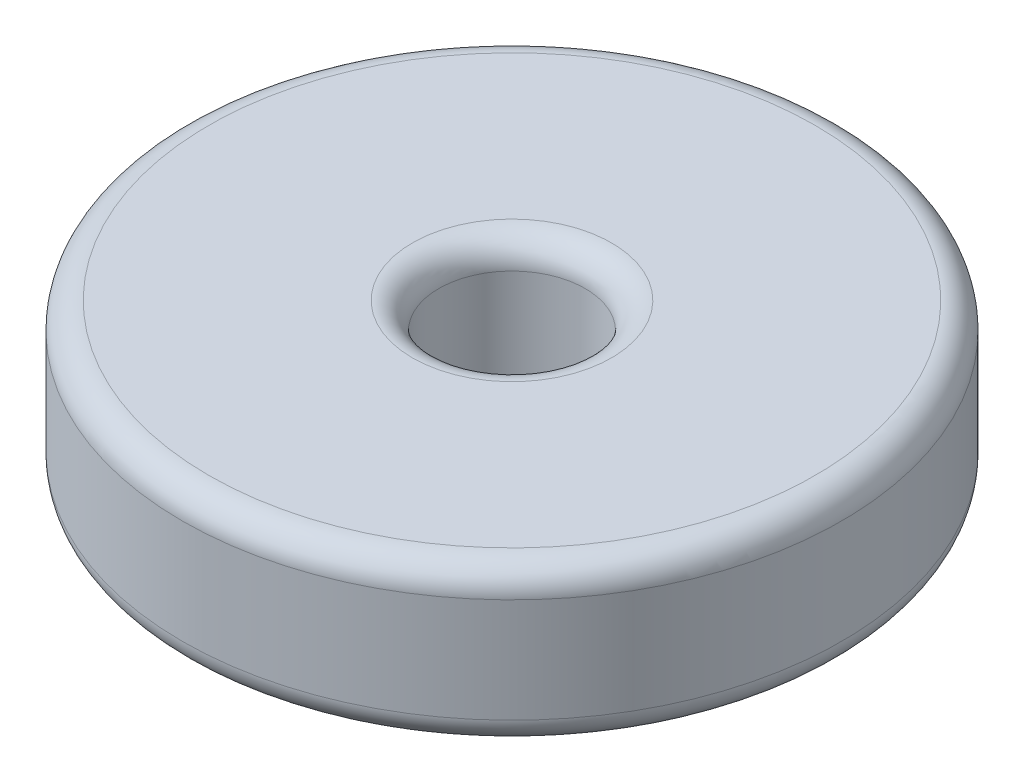
ISO-10303-21;
HEADER;
FILE_DESCRIPTION(('STEP AP214'),'2;1');
FILE_NAME('part.step','',(''),(''),'','','');
FILE_SCHEMA(('AUTOMOTIVE_DESIGN { 1 0 10303 214 1 1 1 1 }'));
ENDSEC;
DATA;
#1=APPLICATION_CONTEXT('core data for automotive mechanical design processes');
#2=APPLICATION_PROTOCOL_DEFINITION('international standard','automotive_design',2000,#1);
#3=PRODUCT_CONTEXT('',#1,'mechanical');
#4=PRODUCT('Part','Part','',(#3));
#5=PRODUCT_RELATED_PRODUCT_CATEGORY('part','',(#4));
#6=PRODUCT_DEFINITION_FORMATION('','',#4);
#7=PRODUCT_DEFINITION_CONTEXT('part definition',#1,'design');
#8=PRODUCT_DEFINITION('design','',#6,#7);
#9=PRODUCT_DEFINITION_SHAPE('','',#8);
#10=(LENGTH_UNIT() NAMED_UNIT(*) SI_UNIT(.MILLI.,.METRE.));
#11=(NAMED_UNIT(*) PLANE_ANGLE_UNIT() SI_UNIT($,.RADIAN.));
#12=(NAMED_UNIT(*) SI_UNIT($,.STERADIAN.) SOLID_ANGLE_UNIT());
#13=UNCERTAINTY_MEASURE_WITH_UNIT(LENGTH_MEASURE(1.E-05),#10,'distance_accuracy_value','');
#14=(GEOMETRIC_REPRESENTATION_CONTEXT(3) GLOBAL_UNCERTAINTY_ASSIGNED_CONTEXT((#13)) GLOBAL_UNIT_ASSIGNED_CONTEXT((#10,
#11,#12)) REPRESENTATION_CONTEXT('',''));
#15=CARTESIAN_POINT('',(0.,0.,0.));
#16=DIRECTION('',(0.,0.,1.));
#17=DIRECTION('',(1.,0.,0.));
#18=AXIS2_PLACEMENT_3D('',#15,#16,#17);
#19=CARTESIAN_POINT('',(0.,5.953125,0.));
#20=DIRECTION('',(0.,-1.,0.));
#21=DIRECTION('',(0.,0.,-1.));
#22=AXIS2_PLACEMENT_3D('',#19,#20,#21);
#23=CYLINDRICAL_SURFACE('',#22,12.5);
#24=CARTESIAN_POINT('',(0.,1.,0.));
#25=DIRECTION('',(0.,1.,0.));
#26=DIRECTION('',(0.,0.,1.));
#27=AXIS2_PLACEMENT_3D('',#24,#25,#26);
#28=CIRCLE('',#27,12.5);
#29=CARTESIAN_POINT('',(0.,1.,12.5));
#30=VERTEX_POINT('',#29);
#31=EDGE_CURVE('E43',#30,#30,#28,.T.);
#32=ORIENTED_EDGE('',*,*,#31,.T.);
#33=EDGE_LOOP('',(#32));
#34=FACE_BOUND('',#33,.T.);
#35=CARTESIAN_POINT('',(0.,4.953125,0.));
#36=DIRECTION('',(0.,1.,0.));
#37=DIRECTION('',(0.,0.,1.));
#38=AXIS2_PLACEMENT_3D('',#35,#36,#37);
#39=CIRCLE('',#38,12.5);
#40=CARTESIAN_POINT('',(0.,4.953125,12.5));
#41=VERTEX_POINT('',#40);
#42=EDGE_CURVE('E47',#41,#41,#39,.F.);
#43=ORIENTED_EDGE('',*,*,#42,.T.);
#44=EDGE_LOOP('',(#43));
#45=FACE_BOUND('',#44,.T.);
#46=ADVANCED_FACE('F32',(#34,#45),#23,.T.);
#47=CARTESIAN_POINT('',(0.,5.953125,0.));
#48=DIRECTION('',(0.,1.,0.));
#49=DIRECTION('',(0.,0.,1.));
#50=AXIS2_PLACEMENT_3D('',#47,#48,#49);
#51=PLANE('',#50);
#52=CARTESIAN_POINT('',(0.,5.953125,0.));
#53=DIRECTION('',(0.,1.,0.));
#54=DIRECTION('',(0.,0.,1.));
#55=AXIS2_PLACEMENT_3D('',#52,#53,#54);
#56=CIRCLE('',#55,11.5);
#57=CARTESIAN_POINT('',(0.,5.953125,11.5));
#58=VERTEX_POINT('',#57);
#59=EDGE_CURVE('E10',#58,#58,#56,.T.);
#60=ORIENTED_EDGE('',*,*,#59,.T.);
#61=EDGE_LOOP('',(#60));
#62=FACE_BOUND('',#61,.T.);
#63=CARTESIAN_POINT('',(0.,5.953125,0.));
#64=DIRECTION('',(0.,1.,0.));
#65=DIRECTION('',(0.,0.,1.));
#66=AXIS2_PLACEMENT_3D('',#63,#64,#65);
#67=CIRCLE('',#66,3.7781);
#68=CARTESIAN_POINT('',(0.,5.953125,3.7781));
#69=VERTEX_POINT('',#68);
#70=EDGE_CURVE('E39',#69,#69,#67,.F.);
#71=ORIENTED_EDGE('',*,*,#70,.T.);
#72=EDGE_LOOP('',(#71));
#73=FACE_BOUND('',#72,.T.);
#74=ADVANCED_FACE('F76',(#62,#73),#51,.T.);
#75=CARTESIAN_POINT('',(0.,0.,0.));
#76=DIRECTION('',(0.,1.,0.));
#77=DIRECTION('',(0.,0.,1.));
#78=AXIS2_PLACEMENT_3D('',#75,#76,#77);
#79=PLANE('',#78);
#80=CARTESIAN_POINT('',(0.,0.,0.));
#81=DIRECTION('',(0.,1.,0.));
#82=DIRECTION('',(0.,0.,1.));
#83=AXIS2_PLACEMENT_3D('',#80,#81,#82);
#84=CIRCLE('',#83,3.7781);
#85=CARTESIAN_POINT('',(0.,0.,3.7781));
#86=VERTEX_POINT('',#85);
#87=EDGE_CURVE('E52',#86,#86,#84,.T.);
#88=ORIENTED_EDGE('',*,*,#87,.T.);
#89=EDGE_LOOP('',(#88));
#90=FACE_BOUND('',#89,.T.);
#91=CARTESIAN_POINT('',(0.,0.,0.));
#92=DIRECTION('',(0.,1.,0.));
#93=DIRECTION('',(0.,0.,1.));
#94=AXIS2_PLACEMENT_3D('',#91,#92,#93);
#95=CIRCLE('',#94,11.5);
#96=CARTESIAN_POINT('',(0.,0.,11.5));
#97=VERTEX_POINT('',#96);
#98=EDGE_CURVE('E55',#97,#97,#95,.F.);
#99=ORIENTED_EDGE('',*,*,#98,.T.);
#100=EDGE_LOOP('',(#99));
#101=FACE_BOUND('',#100,.T.);
#102=ADVANCED_FACE('F82',(#90,#101),#79,.F.);
#103=CARTESIAN_POINT('',(0.,-7.85765339525739,0.));
#104=DIRECTION('',(0.,1.,0.));
#105=DIRECTION('',(0.,0.,1.));
#106=AXIS2_PLACEMENT_3D('',#103,#104,#105);
#107=CYLINDRICAL_SURFACE('',#106,2.7781);
#108=CARTESIAN_POINT('',(0.,1.,0.));
#109=DIRECTION('',(0.,1.,0.));
#110=DIRECTION('',(0.,0.,1.));
#111=AXIS2_PLACEMENT_3D('',#108,#109,#110);
#112=CIRCLE('',#111,2.7781);
#113=CARTESIAN_POINT('',(0.,1.,2.7781));
#114=VERTEX_POINT('',#113);
#115=EDGE_CURVE('E58',#114,#114,#112,.F.);
#116=ORIENTED_EDGE('',*,*,#115,.T.);
#117=EDGE_LOOP('',(#116));
#118=FACE_BOUND('',#117,.T.);
#119=CARTESIAN_POINT('',(0.,4.953125,0.));
#120=DIRECTION('',(0.,1.,0.));
#121=DIRECTION('',(0.,0.,1.));
#122=AXIS2_PLACEMENT_3D('',#119,#120,#121);
#123=CIRCLE('',#122,2.7781);
#124=CARTESIAN_POINT('',(0.,4.953125,2.7781));
#125=VERTEX_POINT('',#124);
#126=EDGE_CURVE('E61',#125,#125,#123,.T.);
#127=ORIENTED_EDGE('',*,*,#126,.T.);
#128=EDGE_LOOP('',(#127));
#129=FACE_BOUND('',#128,.T.);
#130=ADVANCED_FACE('F65',(#118,#129),#107,.F.);
#131=CARTESIAN_POINT('',(0.,1.,0.));
#132=DIRECTION('',(0.,1.,0.));
#133=DIRECTION('',(0.,0.,1.));
#134=AXIS2_PLACEMENT_3D('',#131,#132,#133);
#135=TOROIDAL_SURFACE('',#134,3.7781,1.);
#136=ORIENTED_EDGE('',*,*,#87,.F.);
#137=EDGE_LOOP('',(#136));
#138=FACE_BOUND('',#137,.T.);
#139=ORIENTED_EDGE('',*,*,#115,.F.);
#140=EDGE_LOOP('',(#139));
#141=FACE_BOUND('',#140,.T.);
#142=ADVANCED_FACE('F87',(#138,#141),#135,.T.);
#143=CARTESIAN_POINT('',(0.,1.,0.));
#144=DIRECTION('',(0.,1.,0.));
#145=DIRECTION('',(0.,0.,1.));
#146=AXIS2_PLACEMENT_3D('',#143,#144,#145);
#147=TOROIDAL_SURFACE('',#146,11.5,1.);
#148=ORIENTED_EDGE('',*,*,#98,.F.);
#149=EDGE_LOOP('',(#148));
#150=FACE_BOUND('',#149,.T.);
#151=ORIENTED_EDGE('',*,*,#31,.F.);
#152=EDGE_LOOP('',(#151));
#153=FACE_BOUND('',#152,.T.);
#154=ADVANCED_FACE('F73',(#150,#153),#147,.T.);
#155=CARTESIAN_POINT('',(0.,4.953125,0.));
#156=DIRECTION('',(0.,1.,0.));
#157=DIRECTION('',(0.,0.,1.));
#158=AXIS2_PLACEMENT_3D('',#155,#156,#157);
#159=TOROIDAL_SURFACE('',#158,11.5,1.);
#160=ORIENTED_EDGE('',*,*,#42,.F.);
#161=EDGE_LOOP('',(#160));
#162=FACE_BOUND('',#161,.T.);
#163=ORIENTED_EDGE('',*,*,#59,.F.);
#164=EDGE_LOOP('',(#163));
#165=FACE_BOUND('',#164,.T.);
#166=ADVANCED_FACE('F68',(#162,#165),#159,.T.);
#167=CARTESIAN_POINT('',(0.,4.953125,0.));
#168=DIRECTION('',(0.,1.,0.));
#169=DIRECTION('',(0.,0.,1.));
#170=AXIS2_PLACEMENT_3D('',#167,#168,#169);
#171=TOROIDAL_SURFACE('',#170,3.7781,1.);
#172=ORIENTED_EDGE('',*,*,#70,.F.);
#173=EDGE_LOOP('',(#172));
#174=FACE_BOUND('',#173,.T.);
#175=ORIENTED_EDGE('',*,*,#126,.F.);
#176=EDGE_LOOP('',(#175));
#177=FACE_BOUND('',#176,.T.);
#178=ADVANCED_FACE('F34',(#174,#177),#171,.T.);
#179=CLOSED_SHELL('',(#46,#74,#102,#130,#142,#154,#166,#178));
#180=MANIFOLD_SOLID_BREP('B2',#179);
#181=ADVANCED_BREP_SHAPE_REPRESENTATION('',(#18,#180),#14);
#182=SHAPE_DEFINITION_REPRESENTATION(#9,#181);
ENDSEC;
END-ISO-10303-21;
